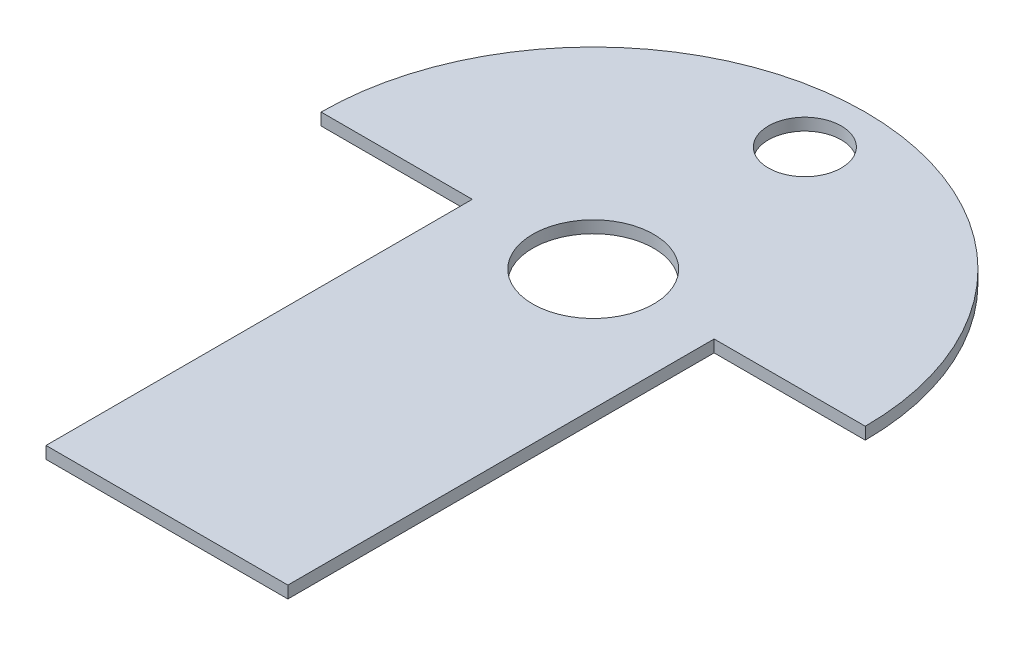
ISO-10303-21;
HEADER;
FILE_DESCRIPTION(('STEP AP214'),'2;1');
FILE_NAME('part.step','',(''),(''),'','','');
FILE_SCHEMA(('AUTOMOTIVE_DESIGN { 1 0 10303 214 1 1 1 1 }'));
ENDSEC;
DATA;
#1=APPLICATION_CONTEXT('core data for automotive mechanical design processes');
#2=APPLICATION_PROTOCOL_DEFINITION('international standard','automotive_design',2000,#1);
#3=PRODUCT_CONTEXT('',#1,'mechanical');
#4=PRODUCT('Part','Part','',(#3));
#5=PRODUCT_RELATED_PRODUCT_CATEGORY('part','',(#4));
#6=PRODUCT_DEFINITION_FORMATION('','',#4);
#7=PRODUCT_DEFINITION_CONTEXT('part definition',#1,'design');
#8=PRODUCT_DEFINITION('design','',#6,#7);
#9=PRODUCT_DEFINITION_SHAPE('','',#8);
#10=(LENGTH_UNIT() NAMED_UNIT(*) SI_UNIT(.MILLI.,.METRE.));
#11=(NAMED_UNIT(*) PLANE_ANGLE_UNIT() SI_UNIT($,.RADIAN.));
#12=(NAMED_UNIT(*) SI_UNIT($,.STERADIAN.) SOLID_ANGLE_UNIT());
#13=UNCERTAINTY_MEASURE_WITH_UNIT(LENGTH_MEASURE(1.E-05),#10,'distance_accuracy_value','');
#14=(GEOMETRIC_REPRESENTATION_CONTEXT(3) GLOBAL_UNCERTAINTY_ASSIGNED_CONTEXT((#13)) GLOBAL_UNIT_ASSIGNED_CONTEXT((#10,
#11,#12)) REPRESENTATION_CONTEXT('',''));
#15=CARTESIAN_POINT('',(0.,0.,0.));
#16=DIRECTION('',(0.,0.,1.));
#17=DIRECTION('',(1.,0.,0.));
#18=AXIS2_PLACEMENT_3D('',#15,#16,#17);
#19=CARTESIAN_POINT('',(15.,2.,0.));
#20=DIRECTION('',(1.,0.,0.));
#21=DIRECTION('',(0.,0.,-1.));
#22=AXIS2_PLACEMENT_3D('',#19,#20,#21);
#23=PLANE('',#22);
#24=DIRECTION('',(0.,0.,1.));
#25=VECTOR('',#24,1.);
#26=CARTESIAN_POINT('',(15.,0.,0.));
#27=LINE('',#26,#25);
#28=CARTESIAN_POINT('',(15.,0.,-40.5));
#29=VERTEX_POINT('',#28);
#30=CARTESIAN_POINT('',(15.,0.,30.));
#31=VERTEX_POINT('',#30);
#32=EDGE_CURVE('E117',#29,#31,#27,.T.);
#33=ORIENTED_EDGE('',*,*,#32,.F.);
#34=DIRECTION('',(0.,-1.,0.));
#35=VECTOR('',#34,1.);
#36=CARTESIAN_POINT('',(15.,2.,-40.5));
#37=LINE('',#36,#35);
#38=CARTESIAN_POINT('',(15.,2.,-40.5));
#39=VERTEX_POINT('',#38);
#40=EDGE_CURVE('E11',#39,#29,#37,.T.);
#41=ORIENTED_EDGE('',*,*,#40,.F.);
#42=DIRECTION('',(0.,0.,1.));
#43=VECTOR('',#42,1.);
#44=CARTESIAN_POINT('',(15.,2.,0.));
#45=LINE('',#44,#43);
#46=CARTESIAN_POINT('',(15.,2.,30.));
#47=VERTEX_POINT('',#46);
#48=EDGE_CURVE('E128',#39,#47,#45,.T.);
#49=ORIENTED_EDGE('',*,*,#48,.T.);
#50=DIRECTION('',(0.,-1.,0.));
#51=VECTOR('',#50,1.);
#52=CARTESIAN_POINT('',(15.,2.,30.));
#53=LINE('',#52,#51);
#54=EDGE_CURVE('E80',#47,#31,#53,.T.);
#55=ORIENTED_EDGE('',*,*,#54,.T.);
#56=EDGE_LOOP('',(#33,#41,#49,#55));
#57=FACE_BOUND('',#56,.T.);
#58=ADVANCED_FACE('F35',(#57),#23,.T.);
#59=CARTESIAN_POINT('',(0.,2.,-40.5));
#60=DIRECTION('',(0.,0.,-1.));
#61=DIRECTION('',(-1.,0.,0.));
#62=AXIS2_PLACEMENT_3D('',#59,#60,#61);
#63=PLANE('',#62);
#64=DIRECTION('',(1.,0.,0.));
#65=VECTOR('',#64,1.);
#66=CARTESIAN_POINT('',(0.,0.,-40.5));
#67=LINE('',#66,#65);
#68=CARTESIAN_POINT('',(40.,0.,-40.5));
#69=VERTEX_POINT('',#68);
#70=EDGE_CURVE('E120',#29,#69,#67,.T.);
#71=ORIENTED_EDGE('',*,*,#70,.T.);
#72=DIRECTION('',(0.,-1.,0.));
#73=VECTOR('',#72,1.);
#74=CARTESIAN_POINT('',(40.,2.,-40.5));
#75=LINE('',#74,#73);
#76=CARTESIAN_POINT('',(40.,2.,-40.5));
#77=VERTEX_POINT('',#76);
#78=EDGE_CURVE('E43',#77,#69,#75,.T.);
#79=ORIENTED_EDGE('',*,*,#78,.F.);
#80=DIRECTION('',(1.,0.,0.));
#81=VECTOR('',#80,1.);
#82=CARTESIAN_POINT('',(0.,2.,-40.5));
#83=LINE('',#82,#81);
#84=EDGE_CURVE('E104',#39,#77,#83,.T.);
#85=ORIENTED_EDGE('',*,*,#84,.F.);
#86=ORIENTED_EDGE('',*,*,#40,.T.);
#87=EDGE_LOOP('',(#71,#79,#85,#86));
#88=FACE_BOUND('',#87,.T.);
#89=ADVANCED_FACE('F179',(#88),#63,.F.);
#90=CARTESIAN_POINT('',(-5.,2.,-40.5));
#91=DIRECTION('',(0.,-1.,0.));
#92=DIRECTION('',(0.,0.,-1.));
#93=AXIS2_PLACEMENT_3D('',#90,#91,#92);
#94=CYLINDRICAL_SURFACE('',#93,45.);
#95=CARTESIAN_POINT('',(-5.,0.,-40.5));
#96=DIRECTION('',(0.,1.,0.));
#97=DIRECTION('',(0.,0.,1.));
#98=AXIS2_PLACEMENT_3D('',#95,#96,#97);
#99=CIRCLE('',#98,45.);
#100=CARTESIAN_POINT('',(-50.,0.,-40.5));
#101=VERTEX_POINT('',#100);
#102=EDGE_CURVE('E123',#69,#101,#99,.T.);
#103=ORIENTED_EDGE('',*,*,#102,.T.);
#104=DIRECTION('',(0.,-1.,0.));
#105=VECTOR('',#104,1.);
#106=CARTESIAN_POINT('',(-50.,2.,-40.5));
#107=LINE('',#106,#105);
#108=CARTESIAN_POINT('',(-50.,2.,-40.5));
#109=VERTEX_POINT('',#108);
#110=EDGE_CURVE('E109',#109,#101,#107,.T.);
#111=ORIENTED_EDGE('',*,*,#110,.F.);
#112=CARTESIAN_POINT('',(-5.,2.,-40.5));
#113=DIRECTION('',(0.,1.,0.));
#114=DIRECTION('',(0.,0.,1.));
#115=AXIS2_PLACEMENT_3D('',#112,#113,#114);
#116=CIRCLE('',#115,45.);
#117=EDGE_CURVE('E99',#77,#109,#116,.T.);
#118=ORIENTED_EDGE('',*,*,#117,.F.);
#119=ORIENTED_EDGE('',*,*,#78,.T.);
#120=EDGE_LOOP('',(#103,#111,#118,#119));
#121=FACE_BOUND('',#120,.T.);
#122=ADVANCED_FACE('F135',(#121),#94,.T.);
#123=CARTESIAN_POINT('',(-25.,0.,-40.5));
#124=VERTEX_POINT('',#123);
#125=EDGE_CURVE('E108',#101,#124,#67,.T.);
#126=ORIENTED_EDGE('',*,*,#125,.T.);
#127=DIRECTION('',(0.,-1.,0.));
#128=VECTOR('',#127,1.);
#129=CARTESIAN_POINT('',(-25.,2.,-40.5));
#130=LINE('',#129,#128);
#131=CARTESIAN_POINT('',(-25.,2.,-40.5));
#132=VERTEX_POINT('',#131);
#133=EDGE_CURVE('E105',#132,#124,#130,.T.);
#134=ORIENTED_EDGE('',*,*,#133,.F.);
#135=EDGE_CURVE('E93',#109,#132,#83,.T.);
#136=ORIENTED_EDGE('',*,*,#135,.F.);
#137=ORIENTED_EDGE('',*,*,#110,.T.);
#138=EDGE_LOOP('',(#126,#134,#136,#137));
#139=FACE_BOUND('',#138,.T.);
#140=ADVANCED_FACE('F106',(#139),#63,.F.);
#141=CARTESIAN_POINT('',(-25.,2.,0.));
#142=DIRECTION('',(1.,0.,0.));
#143=DIRECTION('',(0.,0.,-1.));
#144=AXIS2_PLACEMENT_3D('',#141,#142,#143);
#145=PLANE('',#144);
#146=DIRECTION('',(0.,0.,1.));
#147=VECTOR('',#146,1.);
#148=CARTESIAN_POINT('',(-25.,0.,0.));
#149=LINE('',#148,#147);
#150=CARTESIAN_POINT('',(-25.,0.,30.));
#151=VERTEX_POINT('',#150);
#152=EDGE_CURVE('E73',#124,#151,#149,.T.);
#153=ORIENTED_EDGE('',*,*,#152,.T.);
#154=DIRECTION('',(0.,-1.,0.));
#155=VECTOR('',#154,1.);
#156=CARTESIAN_POINT('',(-25.,2.,30.));
#157=LINE('',#156,#155);
#158=CARTESIAN_POINT('',(-25.,2.,30.));
#159=VERTEX_POINT('',#158);
#160=EDGE_CURVE('E110',#159,#151,#157,.T.);
#161=ORIENTED_EDGE('',*,*,#160,.F.);
#162=DIRECTION('',(0.,0.,1.));
#163=VECTOR('',#162,1.);
#164=CARTESIAN_POINT('',(-25.,2.,0.));
#165=LINE('',#164,#163);
#166=EDGE_CURVE('E97',#132,#159,#165,.T.);
#167=ORIENTED_EDGE('',*,*,#166,.F.);
#168=ORIENTED_EDGE('',*,*,#133,.T.);
#169=EDGE_LOOP('',(#153,#161,#167,#168));
#170=FACE_BOUND('',#169,.T.);
#171=ADVANCED_FACE('F112',(#170),#145,.F.);
#172=CARTESIAN_POINT('',(0.,2.,30.));
#173=DIRECTION('',(0.,0.,-1.));
#174=DIRECTION('',(-1.,0.,0.));
#175=AXIS2_PLACEMENT_3D('',#172,#173,#174);
#176=PLANE('',#175);
#177=DIRECTION('',(1.,0.,0.));
#178=VECTOR('',#177,1.);
#179=CARTESIAN_POINT('',(0.,0.,30.));
#180=LINE('',#179,#178);
#181=EDGE_CURVE('E126',#151,#31,#180,.T.);
#182=ORIENTED_EDGE('',*,*,#181,.T.);
#183=ORIENTED_EDGE('',*,*,#54,.F.);
#184=DIRECTION('',(1.,0.,0.));
#185=VECTOR('',#184,1.);
#186=CARTESIAN_POINT('',(0.,2.,30.));
#187=LINE('',#186,#185);
#188=EDGE_CURVE('E51',#159,#47,#187,.T.);
#189=ORIENTED_EDGE('',*,*,#188,.F.);
#190=ORIENTED_EDGE('',*,*,#160,.T.);
#191=EDGE_LOOP('',(#182,#183,#189,#190));
#192=FACE_BOUND('',#191,.T.);
#193=ADVANCED_FACE('F142',(#192),#176,.F.);
#194=CARTESIAN_POINT('',(0.,2.,0.));
#195=DIRECTION('',(0.,1.,0.));
#196=DIRECTION('',(0.,0.,1.));
#197=AXIS2_PLACEMENT_3D('',#194,#195,#196);
#198=PLANE('',#197);
#199=CARTESIAN_POINT('',(-5.,2.,-75.5));
#200=DIRECTION('',(0.,1.,0.));
#201=DIRECTION('',(0.,0.,1.));
#202=AXIS2_PLACEMENT_3D('',#199,#200,#201);
#203=CIRCLE('',#202,6.03);
#204=CARTESIAN_POINT('',(-5.,2.,-69.47));
#205=VERTEX_POINT('',#204);
#206=EDGE_CURVE('E148',#205,#205,#203,.T.);
#207=ORIENTED_EDGE('',*,*,#206,.F.);
#208=EDGE_LOOP('',(#207));
#209=FACE_BOUND('',#208,.T.);
#210=CARTESIAN_POINT('',(-5.,2.,-40.5));
#211=DIRECTION('',(0.,1.,0.));
#212=DIRECTION('',(0.,0.,1.));
#213=AXIS2_PLACEMENT_3D('',#210,#211,#212);
#214=CIRCLE('',#213,10.);
#215=CARTESIAN_POINT('',(-5.,2.,-30.5));
#216=VERTEX_POINT('',#215);
#217=EDGE_CURVE('E145',#216,#216,#214,.T.);
#218=ORIENTED_EDGE('',*,*,#217,.F.);
#219=EDGE_LOOP('',(#218));
#220=FACE_BOUND('',#219,.T.);
#221=ORIENTED_EDGE('',*,*,#48,.F.);
#222=ORIENTED_EDGE('',*,*,#84,.T.);
#223=ORIENTED_EDGE('',*,*,#117,.T.);
#224=ORIENTED_EDGE('',*,*,#135,.T.);
#225=ORIENTED_EDGE('',*,*,#166,.T.);
#226=ORIENTED_EDGE('',*,*,#188,.T.);
#227=EDGE_LOOP('',(#221,#222,#223,#224,#225,#226));
#228=FACE_BOUND('',#227,.T.);
#229=ADVANCED_FACE('F95',(#209,#220,#228),#198,.T.);
#230=CARTESIAN_POINT('',(0.,0.,0.));
#231=DIRECTION('',(0.,1.,0.));
#232=DIRECTION('',(0.,0.,1.));
#233=AXIS2_PLACEMENT_3D('',#230,#231,#232);
#234=PLANE('',#233);
#235=CARTESIAN_POINT('',(-5.,0.,-75.5));
#236=DIRECTION('',(0.,-1.,0.));
#237=DIRECTION('',(0.,0.,-1.));
#238=AXIS2_PLACEMENT_3D('',#235,#236,#237);
#239=CIRCLE('',#238,6.03);
#240=CARTESIAN_POINT('',(-5.,0.,-81.53));
#241=VERTEX_POINT('',#240);
#242=EDGE_CURVE('E153',#241,#241,#239,.T.);
#243=ORIENTED_EDGE('',*,*,#242,.F.);
#244=EDGE_LOOP('',(#243));
#245=FACE_BOUND('',#244,.T.);
#246=CARTESIAN_POINT('',(-5.,0.,-40.5));
#247=DIRECTION('',(0.,1.,0.));
#248=DIRECTION('',(0.,0.,1.));
#249=AXIS2_PLACEMENT_3D('',#246,#247,#248);
#250=CIRCLE('',#249,10.);
#251=CARTESIAN_POINT('',(-5.,0.,-30.5));
#252=VERTEX_POINT('',#251);
#253=EDGE_CURVE('E121',#252,#252,#250,.T.);
#254=ORIENTED_EDGE('',*,*,#253,.T.);
#255=EDGE_LOOP('',(#254));
#256=FACE_BOUND('',#255,.T.);
#257=ORIENTED_EDGE('',*,*,#32,.T.);
#258=ORIENTED_EDGE('',*,*,#181,.F.);
#259=ORIENTED_EDGE('',*,*,#152,.F.);
#260=ORIENTED_EDGE('',*,*,#125,.F.);
#261=ORIENTED_EDGE('',*,*,#102,.F.);
#262=ORIENTED_EDGE('',*,*,#70,.F.);
#263=EDGE_LOOP('',(#257,#258,#259,#260,#261,#262));
#264=FACE_BOUND('',#263,.T.);
#265=ADVANCED_FACE('F139',(#245,#256,#264),#234,.F.);
#266=CARTESIAN_POINT('',(-5.,0.,-40.5));
#267=DIRECTION('',(0.,1.,0.));
#268=DIRECTION('',(0.,0.,1.));
#269=AXIS2_PLACEMENT_3D('',#266,#267,#268);
#270=CYLINDRICAL_SURFACE('',#269,10.);
#271=ORIENTED_EDGE('',*,*,#253,.F.);
#272=EDGE_LOOP('',(#271));
#273=FACE_BOUND('',#272,.T.);
#274=ORIENTED_EDGE('',*,*,#217,.T.);
#275=EDGE_LOOP('',(#274));
#276=FACE_BOUND('',#275,.T.);
#277=ADVANCED_FACE('F161',(#273,#276),#270,.F.);
#278=CARTESIAN_POINT('',(-5.,10.,-75.5));
#279=DIRECTION('',(0.,-1.,0.));
#280=DIRECTION('',(0.,0.,-1.));
#281=AXIS2_PLACEMENT_3D('',#278,#279,#280);
#282=CYLINDRICAL_SURFACE('',#281,6.03);
#283=ORIENTED_EDGE('',*,*,#206,.T.);
#284=EDGE_LOOP('',(#283));
#285=FACE_BOUND('',#284,.T.);
#286=ORIENTED_EDGE('',*,*,#242,.T.);
#287=EDGE_LOOP('',(#286));
#288=FACE_BOUND('',#287,.T.);
#289=ADVANCED_FACE('F157',(#285,#288),#282,.F.);
#290=CLOSED_SHELL('',(#58,#89,#122,#140,#171,#193,#229,#265,#277,#289));
#291=MANIFOLD_SOLID_BREP('B2',#290);
#292=ADVANCED_BREP_SHAPE_REPRESENTATION('',(#18,#291),#14);
#293=SHAPE_DEFINITION_REPRESENTATION(#9,#292);
ENDSEC;
END-ISO-10303-21;
